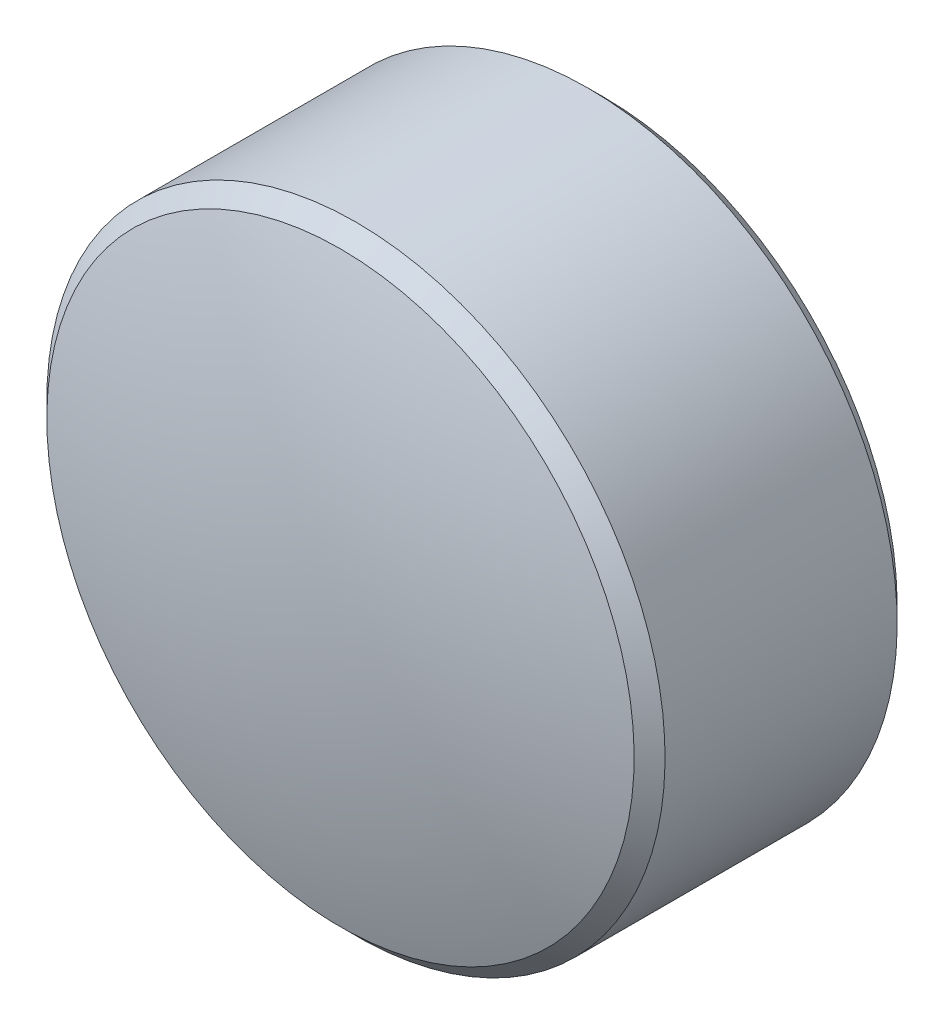
ISO-10303-21;
HEADER;
FILE_DESCRIPTION(('STEP AP214'),'2;1');
FILE_NAME('part.step','',(''),(''),'','','');
FILE_SCHEMA(('AUTOMOTIVE_DESIGN { 1 0 10303 214 1 1 1 1 }'));
ENDSEC;
DATA;
#1=APPLICATION_CONTEXT('core data for automotive mechanical design processes');
#2=APPLICATION_PROTOCOL_DEFINITION('international standard','automotive_design',2000,#1);
#3=PRODUCT_CONTEXT('',#1,'mechanical');
#4=PRODUCT('Part','Part','',(#3));
#5=PRODUCT_RELATED_PRODUCT_CATEGORY('part','',(#4));
#6=PRODUCT_DEFINITION_FORMATION('','',#4);
#7=PRODUCT_DEFINITION_CONTEXT('part definition',#1,'design');
#8=PRODUCT_DEFINITION('design','',#6,#7);
#9=PRODUCT_DEFINITION_SHAPE('','',#8);
#10=(LENGTH_UNIT() NAMED_UNIT(*) SI_UNIT(.MILLI.,.METRE.));
#11=(NAMED_UNIT(*) PLANE_ANGLE_UNIT() SI_UNIT($,.RADIAN.));
#12=(NAMED_UNIT(*) SI_UNIT($,.STERADIAN.) SOLID_ANGLE_UNIT());
#13=UNCERTAINTY_MEASURE_WITH_UNIT(LENGTH_MEASURE(1.E-05),#10,'distance_accuracy_value','');
#14=(GEOMETRIC_REPRESENTATION_CONTEXT(3) GLOBAL_UNCERTAINTY_ASSIGNED_CONTEXT((#13)) GLOBAL_UNIT_ASSIGNED_CONTEXT((#10,
#11,#12)) REPRESENTATION_CONTEXT('',''));
#15=CARTESIAN_POINT('',(0.,0.,0.));
#16=DIRECTION('',(0.,0.,1.));
#17=DIRECTION('',(1.,0.,0.));
#18=AXIS2_PLACEMENT_3D('',#15,#16,#17);
#19=CARTESIAN_POINT('',(0.741175919025709,0.94480337210996,1.10520034104852));
#20=DIRECTION('',(0.,0.,-1.));
#21=DIRECTION('',(0.,1.,0.));
#22=AXIS2_PLACEMENT_3D('',#19,#20,#21);
#23=PLANE('',#22);
#24=CARTESIAN_POINT('',(0.741175919025709,0.94480337210996,1.10520034104852));
#25=DIRECTION('',(0.,0.,-1.));
#26=DIRECTION('',(0.,1.,0.));
#27=AXIS2_PLACEMENT_3D('',#24,#25,#26);
#28=CIRCLE('',#27,0.949999999999999);
#29=CARTESIAN_POINT('',(0.741175919025709,1.89480337210996,1.10520034104852));
#30=VERTEX_POINT('',#29);
#31=EDGE_CURVE('E20',#30,#30,#28,.T.);
#32=ORIENTED_EDGE('',*,*,#31,.T.);
#33=EDGE_LOOP('',(#32));
#34=FACE_BOUND('',#33,.T.);
#35=ADVANCED_FACE('F13',(#34),#23,.T.);
#36=CARTESIAN_POINT('',(0.741175919025709,0.94480337210996,1.10520034104852));
#37=DIRECTION('',(0.,0.,-1.));
#38=DIRECTION('',(0.,1.,0.));
#39=AXIS2_PLACEMENT_3D('',#36,#37,#38);
#40=CYLINDRICAL_SURFACE('',#39,1.);
#41=CARTESIAN_POINT('',(0.741175919025709,0.94480337210996,1.15520034104852));
#42=DIRECTION('',(0.,0.,-1.));
#43=DIRECTION('',(0.,1.,0.));
#44=AXIS2_PLACEMENT_3D('',#41,#42,#43);
#45=CIRCLE('',#44,1.);
#46=CARTESIAN_POINT('',(0.741175919025709,1.94480337210996,1.15520034104852));
#47=VERTEX_POINT('',#46);
#48=EDGE_CURVE('E9',#47,#47,#45,.F.);
#49=ORIENTED_EDGE('',*,*,#48,.T.);
#50=EDGE_LOOP('',(#49));
#51=FACE_BOUND('',#50,.T.);
#52=CARTESIAN_POINT('',(0.741175919025709,0.94480337210996,1.90609820513529));
#53=DIRECTION('',(0.,0.,-1.));
#54=DIRECTION('',(0.,1.,0.));
#55=AXIS2_PLACEMENT_3D('',#52,#53,#54);
#56=CIRCLE('',#55,1.);
#57=CARTESIAN_POINT('',(0.741175919025709,1.94480337210996,1.90609820513529));
#58=VERTEX_POINT('',#57);
#59=EDGE_CURVE('E24',#58,#58,#56,.T.);
#60=ORIENTED_EDGE('',*,*,#59,.T.);
#61=EDGE_LOOP('',(#60));
#62=FACE_BOUND('',#61,.T.);
#63=ADVANCED_FACE('F46',(#51,#62),#40,.T.);
#64=CARTESIAN_POINT('',(0.741175919025709,0.94480337210996,1.90609820513529));
#65=DIRECTION('',(0.,0.,-1.));
#66=DIRECTION('',(0.,1.,0.));
#67=AXIS2_PLACEMENT_3D('',#64,#65,#66);
#68=CONICAL_SURFACE('',#67,1.,0.785398163397448);
#69=CARTESIAN_POINT('',(0.741175919025709,0.94480337210996,1.95609820513529));
#70=DIRECTION('',(0.,0.,-1.));
#71=DIRECTION('',(0.,1.,0.));
#72=AXIS2_PLACEMENT_3D('',#69,#70,#71);
#73=CIRCLE('',#72,0.95);
#74=CARTESIAN_POINT('',(0.741175919025709,1.89480337210996,1.95609820513529));
#75=VERTEX_POINT('',#74);
#76=EDGE_CURVE('E28',#75,#75,#73,.T.);
#77=ORIENTED_EDGE('',*,*,#76,.T.);
#78=EDGE_LOOP('',(#77));
#79=FACE_BOUND('',#78,.T.);
#80=ORIENTED_EDGE('',*,*,#59,.F.);
#81=EDGE_LOOP('',(#80));
#82=FACE_BOUND('',#81,.T.);
#83=ADVANCED_FACE('F34',(#79,#82),#68,.T.);
#84=CARTESIAN_POINT('',(0.741175919025709,0.94480337210996,-0.995799658951479));
#85=DIRECTION('',(0.,0.,-1.));
#86=DIRECTION('',(0.,1.,0.));
#87=AXIS2_PLACEMENT_3D('',#84,#85,#86);
#88=SPHERICAL_SURFACE('',#87,3.101);
#89=ORIENTED_EDGE('',*,*,#76,.F.);
#90=EDGE_LOOP('',(#89));
#91=FACE_BOUND('',#90,.T.);
#92=ADVANCED_FACE('F37',(#91),#88,.T.);
#93=CARTESIAN_POINT('',(0.741175919025709,0.94480337210996,1.10520034104852));
#94=DIRECTION('',(0.,0.,1.));
#95=DIRECTION('',(0.,-1.,0.));
#96=AXIS2_PLACEMENT_3D('',#93,#94,#95);
#97=CONICAL_SURFACE('',#96,0.949999999999999,0.78539816339745);
#98=ORIENTED_EDGE('',*,*,#48,.F.);
#99=EDGE_LOOP('',(#98));
#100=FACE_BOUND('',#99,.T.);
#101=ORIENTED_EDGE('',*,*,#31,.F.);
#102=EDGE_LOOP('',(#101));
#103=FACE_BOUND('',#102,.T.);
#104=ADVANCED_FACE('F15',(#100,#103),#97,.T.);
#105=CLOSED_SHELL('',(#35,#63,#83,#92,#104));
#106=MANIFOLD_SOLID_BREP('B1',#105);
#107=ADVANCED_BREP_SHAPE_REPRESENTATION('',(#18,#106),#14);
#108=SHAPE_DEFINITION_REPRESENTATION(#9,#107);
ENDSEC;
END-ISO-10303-21;
